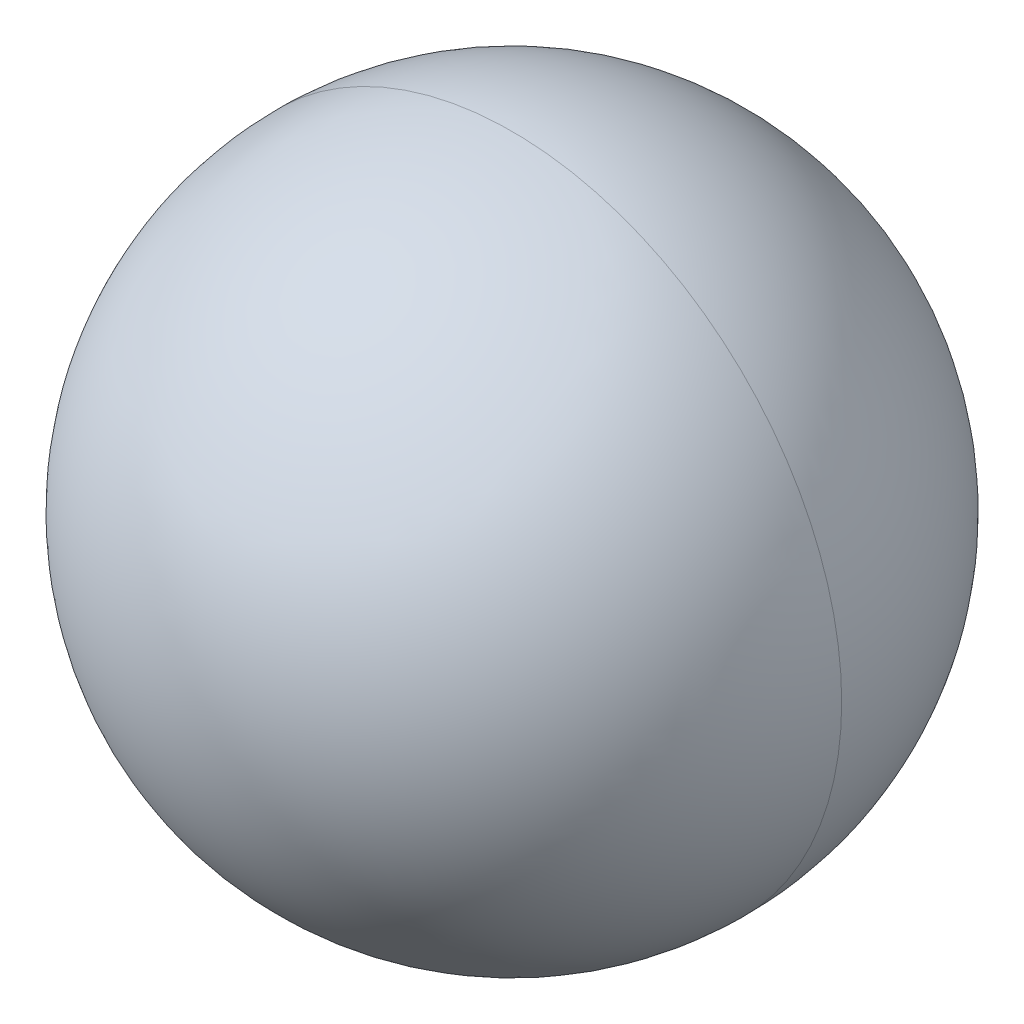
ISO-10303-21;
HEADER;
FILE_DESCRIPTION(('STEP AP214'),'2;1');
FILE_NAME('part.step','',(''),(''),'','','');
FILE_SCHEMA(('AUTOMOTIVE_DESIGN { 1 0 10303 214 1 1 1 1 }'));
ENDSEC;
DATA;
#1=APPLICATION_CONTEXT('core data for automotive mechanical design processes');
#2=APPLICATION_PROTOCOL_DEFINITION('international standard','automotive_design',2000,#1);
#3=PRODUCT_CONTEXT('',#1,'mechanical');
#4=PRODUCT('Part','Part','',(#3));
#5=PRODUCT_RELATED_PRODUCT_CATEGORY('part','',(#4));
#6=PRODUCT_DEFINITION_FORMATION('','',#4);
#7=PRODUCT_DEFINITION_CONTEXT('part definition',#1,'design');
#8=PRODUCT_DEFINITION('design','',#6,#7);
#9=PRODUCT_DEFINITION_SHAPE('','',#8);
#10=(LENGTH_UNIT() NAMED_UNIT(*) SI_UNIT(.MILLI.,.METRE.));
#11=(NAMED_UNIT(*) PLANE_ANGLE_UNIT() SI_UNIT($,.RADIAN.));
#12=(NAMED_UNIT(*) SI_UNIT($,.STERADIAN.) SOLID_ANGLE_UNIT());
#13=UNCERTAINTY_MEASURE_WITH_UNIT(LENGTH_MEASURE(1.E-05),#10,'distance_accuracy_value','');
#14=(GEOMETRIC_REPRESENTATION_CONTEXT(3) GLOBAL_UNCERTAINTY_ASSIGNED_CONTEXT((#13)) GLOBAL_UNIT_ASSIGNED_CONTEXT((#10,
#11,#12)) REPRESENTATION_CONTEXT('',''));
#15=CARTESIAN_POINT('',(0.,0.,0.));
#16=DIRECTION('',(0.,0.,1.));
#17=DIRECTION('',(1.,0.,0.));
#18=AXIS2_PLACEMENT_3D('',#15,#16,#17);
#19=CARTESIAN_POINT('',(0.,0.,0.));
#20=DIRECTION('',(1.,0.,0.));
#21=DIRECTION('',(0.,0.,-1.));
#22=AXIS2_PLACEMENT_3D('',#19,#20,#21);
#23=SPHERICAL_SURFACE('',#22,0.6);
#24=CARTESIAN_POINT('',(0.,0.,0.));
#25=DIRECTION('',(0.,0.,1.));
#26=DIRECTION('',(1.,0.,0.));
#27=AXIS2_PLACEMENT_3D('',#24,#25,#26);
#28=CIRCLE('',#27,0.6);
#29=CARTESIAN_POINT('',(0.6,0.,0.));
#30=VERTEX_POINT('',#29);
#31=CARTESIAN_POINT('',(-0.6,0.,0.));
#32=VERTEX_POINT('',#31);
#33=EDGE_CURVE('E11',#30,#32,#28,.T.);
#34=ORIENTED_EDGE('',*,*,#33,.T.);
#35=CARTESIAN_POINT('',(0.,0.,0.));
#36=DIRECTION('',(0.,0.,-1.));
#37=DIRECTION('',(1.,0.,0.));
#38=AXIS2_PLACEMENT_3D('',#35,#36,#37);
#39=CIRCLE('',#38,0.6);
#40=EDGE_CURVE('E25',#30,#32,#39,.T.);
#41=ORIENTED_EDGE('',*,*,#40,.F.);
#42=EDGE_LOOP('',(#34,#41));
#43=FACE_BOUND('',#42,.T.);
#44=ADVANCED_FACE('F17',(#43),#23,.T.);
#45=CARTESIAN_POINT('',(0.,0.,0.));
#46=DIRECTION('',(1.,0.,0.));
#47=DIRECTION('',(0.,0.,1.));
#48=AXIS2_PLACEMENT_3D('',#45,#46,#47);
#49=SPHERICAL_SURFACE('',#48,0.6);
#50=ORIENTED_EDGE('',*,*,#33,.F.);
#51=ORIENTED_EDGE('',*,*,#40,.T.);
#52=EDGE_LOOP('',(#50,#51));
#53=FACE_BOUND('',#52,.T.);
#54=ADVANCED_FACE('F33',(#53),#49,.T.);
#55=CLOSED_SHELL('',(#44,#54));
#56=MANIFOLD_SOLID_BREP('B1',#55);
#57=ADVANCED_BREP_SHAPE_REPRESENTATION('',(#18,#56),#14);
#58=SHAPE_DEFINITION_REPRESENTATION(#9,#57);
ENDSEC;
END-ISO-10303-21;
